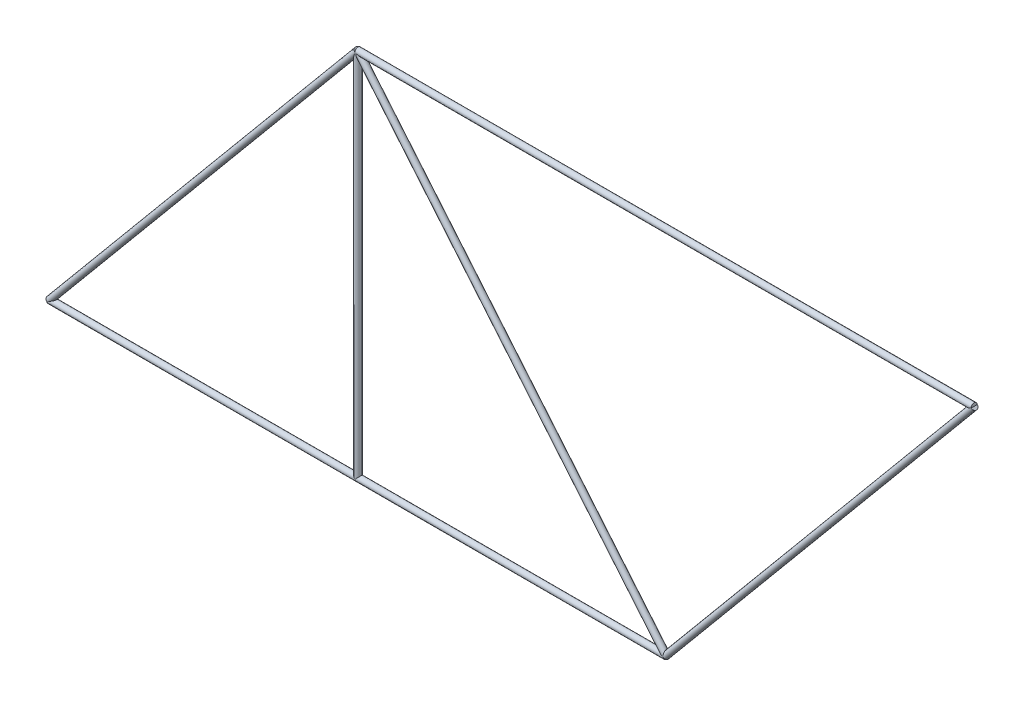
ISO-10303-21;
HEADER;
FILE_DESCRIPTION(('STEP AP214'),'2;1');
FILE_NAME('part.step','',(''),(''),'','','');
FILE_SCHEMA(('AUTOMOTIVE_DESIGN { 1 0 10303 214 1 1 1 1 }'));
ENDSEC;
DATA;
#1=APPLICATION_CONTEXT('core data for automotive mechanical design processes');
#2=APPLICATION_PROTOCOL_DEFINITION('international standard','automotive_design',2000,#1);
#3=PRODUCT_CONTEXT('',#1,'mechanical');
#4=PRODUCT('Part','Part','',(#3));
#5=PRODUCT_RELATED_PRODUCT_CATEGORY('part','',(#4));
#6=PRODUCT_DEFINITION_FORMATION('','',#4);
#7=PRODUCT_DEFINITION_CONTEXT('part definition',#1,'design');
#8=PRODUCT_DEFINITION('design','',#6,#7);
#9=PRODUCT_DEFINITION_SHAPE('','',#8);
#10=(LENGTH_UNIT() NAMED_UNIT(*) SI_UNIT(.MILLI.,.METRE.));
#11=(NAMED_UNIT(*) PLANE_ANGLE_UNIT() SI_UNIT($,.RADIAN.));
#12=(NAMED_UNIT(*) SI_UNIT($,.STERADIAN.) SOLID_ANGLE_UNIT());
#13=UNCERTAINTY_MEASURE_WITH_UNIT(LENGTH_MEASURE(1.E-05),#10,'distance_accuracy_value','');
#14=(GEOMETRIC_REPRESENTATION_CONTEXT(3) GLOBAL_UNCERTAINTY_ASSIGNED_CONTEXT((#13)) GLOBAL_UNIT_ASSIGNED_CONTEXT((#10,
#11,#12)) REPRESENTATION_CONTEXT('',''));
#15=CARTESIAN_POINT('',(0.,0.,0.));
#16=DIRECTION('',(0.,0.,1.));
#17=DIRECTION('',(1.,0.,0.));
#18=AXIS2_PLACEMENT_3D('',#15,#16,#17);
#19=CARTESIAN_POINT('',(5080.,0.,0.));
#20=DIRECTION('',(0.64018439966448,0.768221279597376,0.));
#21=DIRECTION('',(-0.768221279597376,0.64018439966448,0.));
#22=AXIS2_PLACEMENT_3D('',#19,#20,#21);
#23=CYLINDRICAL_SURFACE('',#22,25.4);
#24=CARTESIAN_POINT('',(5080.,-4.44089209850063E-13,0.));
#25=DIRECTION('',(1.,0.,0.));
#26=DIRECTION('',(0.,-1.,0.));
#27=AXIS2_PLACEMENT_3D('',#24,#25,#26);
#28=ELLIPSE('',#27,39.6760683536058,25.4);
#29=CARTESIAN_POINT('',(5080.,-4.44089209850063E-13,-25.4));
#30=VERTEX_POINT('',#29);
#31=CARTESIAN_POINT('',(5080.,-4.44089209850063E-13,25.4));
#32=VERTEX_POINT('',#31);
#33=EDGE_CURVE('E88',#30,#32,#28,.T.);
#34=ORIENTED_EDGE('',*,*,#33,.T.);
#35=CARTESIAN_POINT('',(5080.,-4.44089209850063E-13,0.));
#36=DIRECTION('',(0.90558942122368,0.424155396249724,0.));
#37=DIRECTION('',(0.424155396249724,-0.90558942122368,0.));
#38=AXIS2_PLACEMENT_3D('',#35,#36,#37);
#39=ELLIPSE('',#38,28.0480308235913,25.4);
#40=EDGE_CURVE('E79',#30,#32,#39,.T.);
#41=ORIENTED_EDGE('',*,*,#40,.F.);
#42=EDGE_LOOP('',(#34,#41));
#43=FACE_BOUND('',#42,.T.);
#44=ADVANCED_FACE('F59',(#43),#23,.F.);
#45=CARTESIAN_POINT('',(2540.,-4.44089209850063E-13,0.));
#46=DIRECTION('',(1.,0.,0.));
#47=DIRECTION('',(0.,0.,-1.));
#48=AXIS2_PLACEMENT_3D('',#45,#46,#47);
#49=CYLINDRICAL_SURFACE('',#48,25.4);
#50=CARTESIAN_POINT('',(5080.,-6.66133814775094E-13,0.));
#51=DIRECTION('',(-0.424155396249723,-0.90558942122368,0.));
#52=DIRECTION('',(0.90558942122368,-0.424155396249724,0.));
#53=AXIS2_PLACEMENT_3D('',#50,#51,#52);
#54=ELLIPSE('',#53,59.8837129612884,25.4);
#55=EDGE_CURVE('E91',#32,#30,#54,.T.);
#56=ORIENTED_EDGE('',*,*,#55,.T.);
#57=ORIENTED_EDGE('',*,*,#40,.T.);
#58=EDGE_LOOP('',(#56,#57));
#59=FACE_BOUND('',#58,.T.);
#60=ADVANCED_FACE('F61',(#59),#49,.F.);
#61=CARTESIAN_POINT('',(2540.,3048.,0.));
#62=DIRECTION('',(0.64018439966448,-0.768221279597376,0.));
#63=DIRECTION('',(0.768221279597376,0.64018439966448,0.));
#64=AXIS2_PLACEMENT_3D('',#61,#62,#63);
#65=CYLINDRICAL_SURFACE('',#64,25.4);
#66=ORIENTED_EDGE('',*,*,#55,.F.);
#67=ORIENTED_EDGE('',*,*,#33,.F.);
#68=EDGE_LOOP('',(#66,#67));
#69=FACE_BOUND('',#68,.T.);
#70=CARTESIAN_POINT('',(2540.,3048.,0.));
#71=DIRECTION('',(-0.424155396249723,-0.90558942122368,0.));
#72=DIRECTION('',(0.90558942122368,-0.424155396249724,0.));
#73=AXIS2_PLACEMENT_3D('',#70,#71,#72);
#74=ELLIPSE('',#73,59.8837129612884,25.4);
#75=CARTESIAN_POINT('',(2540.,3048.,25.4));
#76=VERTEX_POINT('',#75);
#77=CARTESIAN_POINT('',(2540.,3048.,-25.4));
#78=VERTEX_POINT('',#77);
#79=EDGE_CURVE('E13',#76,#78,#74,.F.);
#80=ORIENTED_EDGE('',*,*,#79,.F.);
#81=CARTESIAN_POINT('',(2540.,3048.,0.));
#82=DIRECTION('',(1.,0.,0.));
#83=DIRECTION('',(0.,-1.,0.));
#84=AXIS2_PLACEMENT_3D('',#81,#82,#83);
#85=ELLIPSE('',#84,39.6760683536058,25.4);
#86=EDGE_CURVE('E67',#78,#76,#85,.F.);
#87=ORIENTED_EDGE('',*,*,#86,.F.);
#88=EDGE_LOOP('',(#80,#87));
#89=FACE_BOUND('',#88,.T.);
#90=ADVANCED_FACE('F93',(#69,#89),#65,.T.);
#91=CARTESIAN_POINT('',(2540.,3048.,0.));
#92=DIRECTION('',(-0.64018439966448,-0.768221279597376,0.));
#93=DIRECTION('',(0.768221279597376,-0.64018439966448,0.));
#94=AXIS2_PLACEMENT_3D('',#91,#92,#93);
#95=CYLINDRICAL_SURFACE('',#94,25.4);
#96=ORIENTED_EDGE('',*,*,#86,.T.);
#97=CARTESIAN_POINT('',(2540.,3048.,0.));
#98=DIRECTION('',(-0.90558942122368,-0.424155396249724,0.));
#99=DIRECTION('',(-0.424155396249724,0.90558942122368,0.));
#100=AXIS2_PLACEMENT_3D('',#97,#98,#99);
#101=ELLIPSE('',#100,28.0480308235913,25.4);
#102=EDGE_CURVE('E73',#78,#76,#101,.T.);
#103=ORIENTED_EDGE('',*,*,#102,.F.);
#104=EDGE_LOOP('',(#96,#103));
#105=FACE_BOUND('',#104,.T.);
#106=ADVANCED_FACE('F85',(#105),#95,.F.);
#107=CARTESIAN_POINT('',(7620.,3048.,0.));
#108=DIRECTION('',(-1.,0.,0.));
#109=DIRECTION('',(0.,0.,1.));
#110=AXIS2_PLACEMENT_3D('',#107,#108,#109);
#111=CYLINDRICAL_SURFACE('',#110,25.4);
#112=ORIENTED_EDGE('',*,*,#79,.T.);
#113=ORIENTED_EDGE('',*,*,#102,.T.);
#114=EDGE_LOOP('',(#112,#113));
#115=FACE_BOUND('',#114,.T.);
#116=ADVANCED_FACE('F90',(#115),#111,.F.);
#117=CLOSED_SHELL('',(#44,#60,#90,#106,#116));
#118=MANIFOLD_SOLID_BREP('B2',#117);
#119=CARTESIAN_POINT('',(2540.,0.,0.));
#120=DIRECTION('',(0.,1.,0.));
#121=DIRECTION('',(-1.,0.,0.));
#122=AXIS2_PLACEMENT_3D('',#119,#120,#121);
#123=CYLINDRICAL_SURFACE('',#122,25.4);
#124=CARTESIAN_POINT('',(2540.,-4.44089209850063E-13,0.));
#125=DIRECTION('',(0.707106781186547,0.707106781186548,0.));
#126=DIRECTION('',(-0.707106781186547,0.707106781186547,0.));
#127=AXIS2_PLACEMENT_3D('',#124,#125,#126);
#128=ELLIPSE('',#127,35.9210244842766,25.4);
#129=CARTESIAN_POINT('',(2540.,-4.44089209850063E-13,25.4));
#130=VERTEX_POINT('',#129);
#131=CARTESIAN_POINT('',(2540.,-4.44089209850063E-13,-25.4));
#132=VERTEX_POINT('',#131);
#133=EDGE_CURVE('E194',#130,#132,#128,.F.);
#134=ORIENTED_EDGE('',*,*,#133,.F.);
#135=CARTESIAN_POINT('',(2540.,-4.44089209850063E-13,0.));
#136=DIRECTION('',(-0.707106781186547,0.707106781186547,0.));
#137=DIRECTION('',(0.707106781186547,0.707106781186548,0.));
#138=AXIS2_PLACEMENT_3D('',#135,#136,#137);
#139=ELLIPSE('',#138,35.9210244842766,25.4);
#140=EDGE_CURVE('E196',#132,#130,#139,.F.);
#141=ORIENTED_EDGE('',*,*,#140,.F.);
#142=EDGE_LOOP('',(#134,#141));
#143=FACE_BOUND('',#142,.T.);
#144=CARTESIAN_POINT('',(2540.,3048.,0.));
#145=DIRECTION('',(0.707106781186547,0.707106781186548,0.));
#146=DIRECTION('',(-0.707106781186547,0.707106781186547,0.));
#147=AXIS2_PLACEMENT_3D('',#144,#145,#146);
#148=ELLIPSE('',#147,35.9210244842766,25.4);
#149=CARTESIAN_POINT('',(2540.,3048.,25.4));
#150=VERTEX_POINT('',#149);
#151=CARTESIAN_POINT('',(2540.,3048.,-25.4));
#152=VERTEX_POINT('',#151);
#153=EDGE_CURVE('E199',#150,#152,#148,.T.);
#154=ORIENTED_EDGE('',*,*,#153,.F.);
#155=CARTESIAN_POINT('',(2540.,3048.,0.));
#156=DIRECTION('',(-0.940271577683112,0.340425263753018,0.));
#157=DIRECTION('',(0.340425263753018,0.940271577683112,0.));
#158=AXIS2_PLACEMENT_3D('',#155,#156,#157);
#159=ELLIPSE('',#158,74.6125587742158,25.4);
#160=EDGE_CURVE('E57',#152,#150,#159,.T.);
#161=ORIENTED_EDGE('',*,*,#160,.F.);
#162=EDGE_LOOP('',(#154,#161));
#163=FACE_BOUND('',#162,.T.);
#164=ADVANCED_FACE('F171',(#143,#163),#123,.T.);
#165=CARTESIAN_POINT('',(0.,-4.44089209850063E-13,0.));
#166=DIRECTION('',(1.,0.,0.));
#167=DIRECTION('',(0.,0.,-1.));
#168=AXIS2_PLACEMENT_3D('',#165,#166,#167);
#169=CYLINDRICAL_SURFACE('',#168,25.4);
#170=ORIENTED_EDGE('',*,*,#133,.T.);
#171=ORIENTED_EDGE('',*,*,#140,.T.);
#172=EDGE_LOOP('',(#170,#171));
#173=FACE_BOUND('',#172,.T.);
#174=ADVANCED_FACE('F197',(#173),#169,.F.);
#175=CARTESIAN_POINT('',(7620.,3048.,0.));
#176=DIRECTION('',(-1.,0.,0.));
#177=DIRECTION('',(0.,0.,1.));
#178=AXIS2_PLACEMENT_3D('',#175,#176,#177);
#179=CYLINDRICAL_SURFACE('',#178,25.4);
#180=ORIENTED_EDGE('',*,*,#153,.T.);
#181=CARTESIAN_POINT('',(2540.,3048.,0.));
#182=DIRECTION('',(-0.90558942122368,-0.424155396249724,0.));
#183=DIRECTION('',(-0.424155396249724,0.90558942122368,0.));
#184=AXIS2_PLACEMENT_3D('',#181,#182,#183);
#185=ELLIPSE('',#184,28.0480308235913,25.4);
#186=EDGE_CURVE('E175',#152,#150,#185,.T.);
#187=ORIENTED_EDGE('',*,*,#186,.T.);
#188=EDGE_LOOP('',(#180,#187));
#189=FACE_BOUND('',#188,.T.);
#190=ADVANCED_FACE('F173',(#189),#179,.F.);
#191=CARTESIAN_POINT('',(2540.,3048.,0.));
#192=DIRECTION('',(-0.64018439966448,-0.768221279597376,0.));
#193=DIRECTION('',(0.768221279597376,-0.64018439966448,0.));
#194=AXIS2_PLACEMENT_3D('',#191,#192,#193);
#195=CYLINDRICAL_SURFACE('',#194,25.4);
#196=ORIENTED_EDGE('',*,*,#160,.T.);
#197=ORIENTED_EDGE('',*,*,#186,.F.);
#198=EDGE_LOOP('',(#196,#197));
#199=FACE_BOUND('',#198,.T.);
#200=ADVANCED_FACE('F206',(#199),#195,.F.);
#201=CLOSED_SHELL('',(#164,#174,#190,#200));
#202=MANIFOLD_SOLID_BREP('B7',#201);
#203=CARTESIAN_POINT('',(0.,-4.44089209850063E-13,0.));
#204=DIRECTION('',(1.,0.,0.));
#205=DIRECTION('',(0.,0.,-1.));
#206=AXIS2_PLACEMENT_3D('',#203,#204,#205);
#207=CYLINDRICAL_SURFACE('',#206,25.4);
#208=CARTESIAN_POINT('',(0.,-4.44089209850063E-13,0.));
#209=DIRECTION('',(-1.,0.,0.));
#210=DIRECTION('',(0.,-1.,0.));
#211=AXIS2_PLACEMENT_3D('',#208,#209,#210);
#212=CIRCLE('',#211,25.4);
#213=CARTESIAN_POINT('',(0.,-25.4000000000004,0.));
#214=VERTEX_POINT('',#213);
#215=EDGE_CURVE('E170',#214,#214,#212,.T.);
#216=ORIENTED_EDGE('',*,*,#215,.F.);
#217=EDGE_LOOP('',(#216));
#218=FACE_BOUND('',#217,.T.);
#219=CARTESIAN_POINT('',(2540.,-4.44089209850063E-13,0.));
#220=DIRECTION('',(-1.,0.,0.));
#221=DIRECTION('',(0.,-1.,0.));
#222=AXIS2_PLACEMENT_3D('',#219,#220,#221);
#223=CIRCLE('',#222,25.4);
#224=CARTESIAN_POINT('',(2540.,-25.4000000000004,0.));
#225=VERTEX_POINT('',#224);
#226=EDGE_CURVE('E278',#225,#225,#223,.T.);
#227=ORIENTED_EDGE('',*,*,#226,.T.);
#228=EDGE_LOOP('',(#227));
#229=FACE_BOUND('',#228,.T.);
#230=ADVANCED_FACE('F275',(#218,#229),#207,.T.);
#231=CARTESIAN_POINT('',(0.,-4.44089209850063E-13,0.));
#232=DIRECTION('',(-1.,0.,0.));
#233=DIRECTION('',(0.,-1.,0.));
#234=AXIS2_PLACEMENT_3D('',#231,#232,#233);
#235=PLANE('',#234);
#236=ORIENTED_EDGE('',*,*,#215,.T.);
#237=EDGE_LOOP('',(#236));
#238=FACE_BOUND('',#237,.T.);
#239=ADVANCED_FACE('F290',(#238),#235,.T.);
#240=CARTESIAN_POINT('',(2540.,-4.44089209850063E-13,0.));
#241=DIRECTION('',(-1.,0.,0.));
#242=DIRECTION('',(0.,-1.,0.));
#243=AXIS2_PLACEMENT_3D('',#240,#241,#242);
#244=PLANE('',#243);
#245=ORIENTED_EDGE('',*,*,#226,.F.);
#246=EDGE_LOOP('',(#245));
#247=FACE_BOUND('',#246,.T.);
#248=ADVANCED_FACE('F288',(#247),#244,.F.);
#249=CLOSED_SHELL('',(#230,#239,#248));
#250=MANIFOLD_SOLID_BREP('B51',#249);
#251=CARTESIAN_POINT('',(2540.,-4.44089209850063E-13,0.));
#252=DIRECTION('',(1.,0.,0.));
#253=DIRECTION('',(0.,0.,-1.));
#254=AXIS2_PLACEMENT_3D('',#251,#252,#253);
#255=CYLINDRICAL_SURFACE('',#254,25.4);
#256=CARTESIAN_POINT('',(2540.,-4.44089209850063E-13,0.));
#257=DIRECTION('',(-1.,0.,0.));
#258=DIRECTION('',(0.,-1.,0.));
#259=AXIS2_PLACEMENT_3D('',#256,#257,#258);
#260=CIRCLE('',#259,25.4);
#261=CARTESIAN_POINT('',(2540.,-25.4000000000004,0.));
#262=VERTEX_POINT('',#261);
#263=EDGE_CURVE('E274',#262,#262,#260,.T.);
#264=ORIENTED_EDGE('',*,*,#263,.F.);
#265=EDGE_LOOP('',(#264));
#266=FACE_BOUND('',#265,.T.);
#267=CARTESIAN_POINT('',(5080.,-4.44089209850063E-13,0.));
#268=DIRECTION('',(-1.,0.,0.));
#269=DIRECTION('',(0.,-1.,0.));
#270=AXIS2_PLACEMENT_3D('',#267,#268,#269);
#271=CIRCLE('',#270,25.4);
#272=CARTESIAN_POINT('',(5080.,-25.4000000000004,0.));
#273=VERTEX_POINT('',#272);
#274=EDGE_CURVE('E327',#273,#273,#271,.T.);
#275=ORIENTED_EDGE('',*,*,#274,.T.);
#276=EDGE_LOOP('',(#275));
#277=FACE_BOUND('',#276,.T.);
#278=ADVANCED_FACE('F324',(#266,#277),#255,.T.);
#279=CARTESIAN_POINT('',(2540.,-4.44089209850063E-13,0.));
#280=DIRECTION('',(-1.,0.,0.));
#281=DIRECTION('',(0.,-1.,0.));
#282=AXIS2_PLACEMENT_3D('',#279,#280,#281);
#283=PLANE('',#282);
#284=ORIENTED_EDGE('',*,*,#263,.T.);
#285=EDGE_LOOP('',(#284));
#286=FACE_BOUND('',#285,.T.);
#287=ADVANCED_FACE('F339',(#286),#283,.T.);
#288=CARTESIAN_POINT('',(5080.,-4.44089209850063E-13,0.));
#289=DIRECTION('',(-1.,0.,0.));
#290=DIRECTION('',(0.,-1.,0.));
#291=AXIS2_PLACEMENT_3D('',#288,#289,#290);
#292=PLANE('',#291);
#293=ORIENTED_EDGE('',*,*,#274,.F.);
#294=EDGE_LOOP('',(#293));
#295=FACE_BOUND('',#294,.T.);
#296=ADVANCED_FACE('F337',(#295),#292,.F.);
#297=CLOSED_SHELL('',(#278,#287,#296));
#298=MANIFOLD_SOLID_BREP('B165',#297);
#299=CARTESIAN_POINT('',(5080.,0.,0.));
#300=DIRECTION('',(0.64018439966448,0.768221279597376,0.));
#301=DIRECTION('',(-0.768221279597376,0.64018439966448,0.));
#302=AXIS2_PLACEMENT_3D('',#299,#300,#301);
#303=CYLINDRICAL_SURFACE('',#302,25.4);
#304=CARTESIAN_POINT('',(5080.,0.,0.));
#305=DIRECTION('',(-0.64018439966448,-0.768221279597376,0.));
#306=DIRECTION('',(0.768221279597376,-0.64018439966448,0.));
#307=AXIS2_PLACEMENT_3D('',#304,#305,#306);
#308=CIRCLE('',#307,25.4);
#309=CARTESIAN_POINT('',(5099.51282050177,-16.2606837514778,0.));
#310=VERTEX_POINT('',#309);
#311=EDGE_CURVE('E323',#310,#310,#308,.T.);
#312=ORIENTED_EDGE('',*,*,#311,.F.);
#313=EDGE_LOOP('',(#312));
#314=FACE_BOUND('',#313,.T.);
#315=CARTESIAN_POINT('',(7620.,3048.,0.));
#316=DIRECTION('',(-0.64018439966448,-0.768221279597376,0.));
#317=DIRECTION('',(0.768221279597376,-0.64018439966448,0.));
#318=AXIS2_PLACEMENT_3D('',#315,#316,#317);
#319=CIRCLE('',#318,25.4);
#320=CARTESIAN_POINT('',(7639.51282050177,3031.73931624852,0.));
#321=VERTEX_POINT('',#320);
#322=EDGE_CURVE('E376',#321,#321,#319,.T.);
#323=ORIENTED_EDGE('',*,*,#322,.T.);
#324=EDGE_LOOP('',(#323));
#325=FACE_BOUND('',#324,.T.);
#326=ADVANCED_FACE('F373',(#314,#325),#303,.T.);
#327=CARTESIAN_POINT('',(5080.,0.,0.));
#328=DIRECTION('',(-0.64018439966448,-0.768221279597376,0.));
#329=DIRECTION('',(0.768221279597376,-0.64018439966448,0.));
#330=AXIS2_PLACEMENT_3D('',#327,#328,#329);
#331=PLANE('',#330);
#332=ORIENTED_EDGE('',*,*,#311,.T.);
#333=EDGE_LOOP('',(#332));
#334=FACE_BOUND('',#333,.T.);
#335=ADVANCED_FACE('F388',(#334),#331,.T.);
#336=CARTESIAN_POINT('',(7620.,3048.,0.));
#337=DIRECTION('',(-0.64018439966448,-0.768221279597376,0.));
#338=DIRECTION('',(0.768221279597376,-0.64018439966448,0.));
#339=AXIS2_PLACEMENT_3D('',#336,#337,#338);
#340=PLANE('',#339);
#341=ORIENTED_EDGE('',*,*,#322,.F.);
#342=EDGE_LOOP('',(#341));
#343=FACE_BOUND('',#342,.T.);
#344=ADVANCED_FACE('F386',(#343),#340,.F.);
#345=CLOSED_SHELL('',(#326,#335,#344));
#346=MANIFOLD_SOLID_BREP('B269',#345);
#347=CARTESIAN_POINT('',(7620.,3048.,0.));
#348=DIRECTION('',(-1.,0.,0.));
#349=DIRECTION('',(0.,0.,1.));
#350=AXIS2_PLACEMENT_3D('',#347,#348,#349);
#351=CYLINDRICAL_SURFACE('',#350,25.4);
#352=CARTESIAN_POINT('',(7620.,3048.,0.));
#353=DIRECTION('',(1.,0.,0.));
#354=DIRECTION('',(0.,1.,0.));
#355=AXIS2_PLACEMENT_3D('',#352,#353,#354);
#356=CIRCLE('',#355,25.4);
#357=CARTESIAN_POINT('',(7620.,3073.4,0.));
#358=VERTEX_POINT('',#357);
#359=EDGE_CURVE('E372',#358,#358,#356,.T.);
#360=ORIENTED_EDGE('',*,*,#359,.F.);
#361=EDGE_LOOP('',(#360));
#362=FACE_BOUND('',#361,.T.);
#363=CARTESIAN_POINT('',(2540.,3048.,0.));
#364=DIRECTION('',(1.,0.,0.));
#365=DIRECTION('',(0.,1.,0.));
#366=AXIS2_PLACEMENT_3D('',#363,#364,#365);
#367=CIRCLE('',#366,25.4);
#368=CARTESIAN_POINT('',(2540.,3073.4,0.));
#369=VERTEX_POINT('',#368);
#370=EDGE_CURVE('E424',#369,#369,#367,.T.);
#371=ORIENTED_EDGE('',*,*,#370,.T.);
#372=EDGE_LOOP('',(#371));
#373=FACE_BOUND('',#372,.T.);
#374=ADVANCED_FACE('F421',(#362,#373),#351,.T.);
#375=CARTESIAN_POINT('',(7620.,3048.,0.));
#376=DIRECTION('',(1.,0.,0.));
#377=DIRECTION('',(0.,1.,0.));
#378=AXIS2_PLACEMENT_3D('',#375,#376,#377);
#379=PLANE('',#378);
#380=ORIENTED_EDGE('',*,*,#359,.T.);
#381=EDGE_LOOP('',(#380));
#382=FACE_BOUND('',#381,.T.);
#383=ADVANCED_FACE('F438',(#382),#379,.T.);
#384=CARTESIAN_POINT('',(2540.,3048.,0.));
#385=DIRECTION('',(1.,0.,0.));
#386=DIRECTION('',(0.,1.,0.));
#387=AXIS2_PLACEMENT_3D('',#384,#385,#386);
#388=PLANE('',#387);
#389=ORIENTED_EDGE('',*,*,#370,.F.);
#390=EDGE_LOOP('',(#389));
#391=FACE_BOUND('',#390,.T.);
#392=ADVANCED_FACE('F436',(#391),#388,.F.);
#393=CLOSED_SHELL('',(#374,#383,#392));
#394=MANIFOLD_SOLID_BREP('B318',#393);
#395=CARTESIAN_POINT('',(2540.,3048.,0.));
#396=DIRECTION('',(-0.64018439966448,-0.768221279597376,0.));
#397=DIRECTION('',(0.768221279597377,-0.64018439966448,0.));
#398=AXIS2_PLACEMENT_3D('',#395,#396,#397);
#399=CYLINDRICAL_SURFACE('',#398,25.4);
#400=CARTESIAN_POINT('',(2540.,3048.,0.));
#401=DIRECTION('',(0.64018439966448,0.768221279597377,0.));
#402=DIRECTION('',(-0.768221279597377,0.64018439966448,0.));
#403=AXIS2_PLACEMENT_3D('',#400,#401,#402);
#404=CIRCLE('',#403,25.4);
#405=CARTESIAN_POINT('',(2520.48717949823,3064.26068375148,0.));
#406=VERTEX_POINT('',#405);
#407=EDGE_CURVE('E420',#406,#406,#404,.T.);
#408=ORIENTED_EDGE('',*,*,#407,.F.);
#409=EDGE_LOOP('',(#408));
#410=FACE_BOUND('',#409,.T.);
#411=CARTESIAN_POINT('',(0.,-4.44089209850063E-13,0.));
#412=DIRECTION('',(0.64018439966448,0.768221279597377,0.));
#413=DIRECTION('',(-0.768221279597377,0.64018439966448,0.));
#414=AXIS2_PLACEMENT_3D('',#411,#412,#413);
#415=CIRCLE('',#414,25.4);
#416=CARTESIAN_POINT('',(-19.5128205017734,16.2606837514774,0.));
#417=VERTEX_POINT('',#416);
#418=EDGE_CURVE('E473',#417,#417,#415,.T.);
#419=ORIENTED_EDGE('',*,*,#418,.T.);
#420=EDGE_LOOP('',(#419));
#421=FACE_BOUND('',#420,.T.);
#422=ADVANCED_FACE('F470',(#410,#421),#399,.T.);
#423=CARTESIAN_POINT('',(2540.,3048.,0.));
#424=DIRECTION('',(0.64018439966448,0.768221279597377,0.));
#425=DIRECTION('',(-0.768221279597377,0.64018439966448,0.));
#426=AXIS2_PLACEMENT_3D('',#423,#424,#425);
#427=PLANE('',#426);
#428=ORIENTED_EDGE('',*,*,#407,.T.);
#429=EDGE_LOOP('',(#428));
#430=FACE_BOUND('',#429,.T.);
#431=ADVANCED_FACE('F485',(#430),#427,.T.);
#432=CARTESIAN_POINT('',(0.,-4.44089209850063E-13,0.));
#433=DIRECTION('',(0.64018439966448,0.768221279597377,0.));
#434=DIRECTION('',(-0.768221279597377,0.64018439966448,0.));
#435=AXIS2_PLACEMENT_3D('',#432,#433,#434);
#436=PLANE('',#435);
#437=ORIENTED_EDGE('',*,*,#418,.F.);
#438=EDGE_LOOP('',(#437));
#439=FACE_BOUND('',#438,.T.);
#440=ADVANCED_FACE('F483',(#439),#436,.F.);
#441=CLOSED_SHELL('',(#422,#431,#440));
#442=MANIFOLD_SOLID_BREP('B367',#441);
#443=ADVANCED_BREP_SHAPE_REPRESENTATION('',(#18,#118,#202,#250,#298,#346,#394,#442),#14);
#444=SHAPE_DEFINITION_REPRESENTATION(#9,#443);
ENDSEC;
END-ISO-10303-21;
